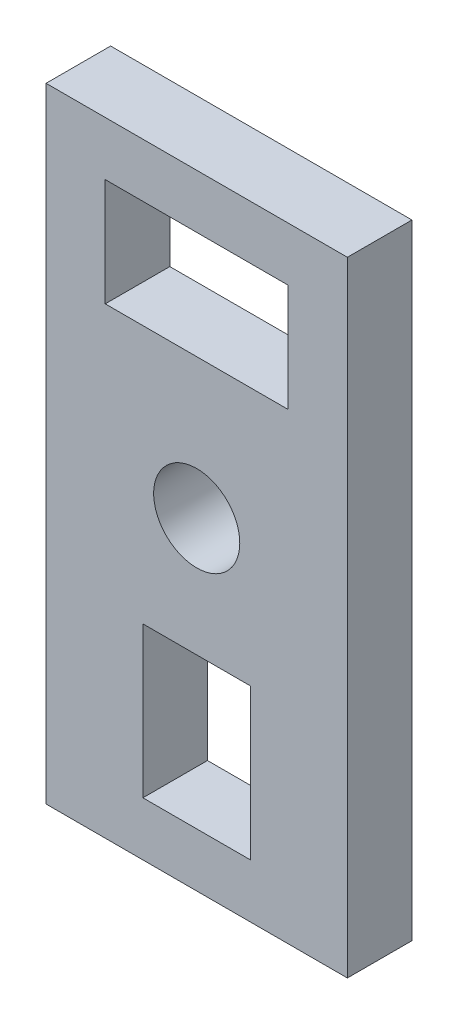
ISO-10303-21;
HEADER;
FILE_DESCRIPTION(('STEP AP214'),'2;1');
FILE_NAME('part.step','',(''),(''),'','','');
FILE_SCHEMA(('AUTOMOTIVE_DESIGN { 1 0 10303 214 1 1 1 1 }'));
ENDSEC;
DATA;
#1=APPLICATION_CONTEXT('core data for automotive mechanical design processes');
#2=APPLICATION_PROTOCOL_DEFINITION('international standard','automotive_design',2000,#1);
#3=PRODUCT_CONTEXT('',#1,'mechanical');
#4=PRODUCT('Part','Part','',(#3));
#5=PRODUCT_RELATED_PRODUCT_CATEGORY('part','',(#4));
#6=PRODUCT_DEFINITION_FORMATION('','',#4);
#7=PRODUCT_DEFINITION_CONTEXT('part definition',#1,'design');
#8=PRODUCT_DEFINITION('design','',#6,#7);
#9=PRODUCT_DEFINITION_SHAPE('','',#8);
#10=(LENGTH_UNIT() NAMED_UNIT(*) SI_UNIT(.MILLI.,.METRE.));
#11=(NAMED_UNIT(*) PLANE_ANGLE_UNIT() SI_UNIT($,.RADIAN.));
#12=(NAMED_UNIT(*) SI_UNIT($,.STERADIAN.) SOLID_ANGLE_UNIT());
#13=UNCERTAINTY_MEASURE_WITH_UNIT(LENGTH_MEASURE(1.E-05),#10,'distance_accuracy_value','');
#14=(GEOMETRIC_REPRESENTATION_CONTEXT(3) GLOBAL_UNCERTAINTY_ASSIGNED_CONTEXT((#13)) GLOBAL_UNIT_ASSIGNED_CONTEXT((#10,
#11,#12)) REPRESENTATION_CONTEXT('',''));
#15=CARTESIAN_POINT('',(0.,0.,0.));
#16=DIRECTION('',(0.,0.,1.));
#17=DIRECTION('',(1.,0.,0.));
#18=AXIS2_PLACEMENT_3D('',#15,#16,#17);
#19=CARTESIAN_POINT('',(0.,0.,3.));
#20=DIRECTION('',(0.,0.,-1.));
#21=DIRECTION('',(-1.,0.,0.));
#22=AXIS2_PLACEMENT_3D('',#19,#20,#21);
#23=PLANE('',#22);
#24=DIRECTION('',(0.,-1.,0.));
#25=VECTOR('',#24,1.);
#26=CARTESIAN_POINT('',(17.,0.,3.));
#27=LINE('',#26,#25);
#28=CARTESIAN_POINT('',(17.,34.,3.));
#29=VERTEX_POINT('',#28);
#30=CARTESIAN_POINT('',(17.,5.,3.));
#31=VERTEX_POINT('',#30);
#32=EDGE_CURVE('E153',#29,#31,#27,.T.);
#33=ORIENTED_EDGE('',*,*,#32,.F.);
#34=DIRECTION('',(1.,0.,0.));
#35=VECTOR('',#34,1.);
#36=CARTESIAN_POINT('',(0.,34.,3.));
#37=LINE('',#36,#35);
#38=CARTESIAN_POINT('',(3.,34.,3.));
#39=VERTEX_POINT('',#38);
#40=EDGE_CURVE('E57',#39,#29,#37,.T.);
#41=ORIENTED_EDGE('',*,*,#40,.F.);
#42=DIRECTION('',(0.,1.,0.));
#43=VECTOR('',#42,1.);
#44=CARTESIAN_POINT('',(3.,0.,3.));
#45=LINE('',#44,#43);
#46=CARTESIAN_POINT('',(3.,5.,3.));
#47=VERTEX_POINT('',#46);
#48=EDGE_CURVE('E144',#47,#39,#45,.T.);
#49=ORIENTED_EDGE('',*,*,#48,.F.);
#50=DIRECTION('',(1.,0.,0.));
#51=VECTOR('',#50,1.);
#52=CARTESIAN_POINT('',(0.,5.,3.));
#53=LINE('',#52,#51);
#54=EDGE_CURVE('E160',#47,#31,#53,.T.);
#55=ORIENTED_EDGE('',*,*,#54,.T.);
#56=EDGE_LOOP('',(#33,#41,#49,#55));
#57=FACE_BOUND('',#56,.T.);
#58=DIRECTION('',(1.,0.,0.));
#59=VECTOR('',#58,1.);
#60=CARTESIAN_POINT('',(5.75,26.5,3.));
#61=LINE('',#60,#59);
#62=CARTESIAN_POINT('',(5.75,26.5,3.));
#63=VERTEX_POINT('',#62);
#64=CARTESIAN_POINT('',(14.25,26.5,3.));
#65=VERTEX_POINT('',#64);
#66=EDGE_CURVE('E191',#63,#65,#61,.T.);
#67=ORIENTED_EDGE('',*,*,#66,.F.);
#68=DIRECTION('',(0.,-1.,0.));
#69=VECTOR('',#68,1.);
#70=CARTESIAN_POINT('',(5.75,31.5,3.));
#71=LINE('',#70,#69);
#72=CARTESIAN_POINT('',(5.75,31.5,3.));
#73=VERTEX_POINT('',#72);
#74=EDGE_CURVE('E188',#73,#63,#71,.T.);
#75=ORIENTED_EDGE('',*,*,#74,.F.);
#76=DIRECTION('',(-1.,0.,0.));
#77=VECTOR('',#76,1.);
#78=CARTESIAN_POINT('',(5.75,31.5,3.));
#79=LINE('',#78,#77);
#80=CARTESIAN_POINT('',(14.25,31.5,3.));
#81=VERTEX_POINT('',#80);
#82=EDGE_CURVE('E199',#81,#73,#79,.T.);
#83=ORIENTED_EDGE('',*,*,#82,.F.);
#84=DIRECTION('',(0.,1.,0.));
#85=VECTOR('',#84,1.);
#86=CARTESIAN_POINT('',(14.25,31.5,3.));
#87=LINE('',#86,#85);
#88=EDGE_CURVE('E195',#65,#81,#87,.T.);
#89=ORIENTED_EDGE('',*,*,#88,.F.);
#90=EDGE_LOOP('',(#67,#75,#83,#89));
#91=FACE_BOUND('',#90,.T.);
#92=DIRECTION('',(1.,0.,0.));
#93=VECTOR('',#92,1.);
#94=CARTESIAN_POINT('',(7.5,7.5,3.));
#95=LINE('',#94,#93);
#96=CARTESIAN_POINT('',(7.5,7.5,3.));
#97=VERTEX_POINT('',#96);
#98=CARTESIAN_POINT('',(12.5,7.5,3.));
#99=VERTEX_POINT('',#98);
#100=EDGE_CURVE('E231',#97,#99,#95,.T.);
#101=ORIENTED_EDGE('',*,*,#100,.F.);
#102=DIRECTION('',(0.,-1.,0.));
#103=VECTOR('',#102,1.);
#104=CARTESIAN_POINT('',(7.5,14.5,3.));
#105=LINE('',#104,#103);
#106=CARTESIAN_POINT('',(7.5,14.5,3.));
#107=VERTEX_POINT('',#106);
#108=EDGE_CURVE('E228',#107,#97,#105,.T.);
#109=ORIENTED_EDGE('',*,*,#108,.F.);
#110=DIRECTION('',(-1.,0.,0.));
#111=VECTOR('',#110,1.);
#112=CARTESIAN_POINT('',(7.5,14.5,3.));
#113=LINE('',#112,#111);
#114=CARTESIAN_POINT('',(12.5,14.5,3.));
#115=VERTEX_POINT('',#114);
#116=EDGE_CURVE('E239',#115,#107,#113,.T.);
#117=ORIENTED_EDGE('',*,*,#116,.F.);
#118=DIRECTION('',(0.,1.,0.));
#119=VECTOR('',#118,1.);
#120=CARTESIAN_POINT('',(12.5,14.5,3.));
#121=LINE('',#120,#119);
#122=EDGE_CURVE('E235',#99,#115,#121,.T.);
#123=ORIENTED_EDGE('',*,*,#122,.F.);
#124=EDGE_LOOP('',(#101,#109,#117,#123));
#125=FACE_BOUND('',#124,.T.);
#126=CARTESIAN_POINT('',(10.,20.,3.));
#127=DIRECTION('',(0.,0.,1.));
#128=DIRECTION('',(1.,0.,0.));
#129=AXIS2_PLACEMENT_3D('',#126,#127,#128);
#130=CIRCLE('',#129,2.);
#131=CARTESIAN_POINT('',(12.,20.,3.));
#132=VERTEX_POINT('',#131);
#133=EDGE_CURVE('E220',#132,#132,#130,.T.);
#134=ORIENTED_EDGE('',*,*,#133,.F.);
#135=EDGE_LOOP('',(#134));
#136=FACE_BOUND('',#135,.T.);
#137=ADVANCED_FACE('F39',(#57,#91,#125,#136),#23,.F.);
#138=CARTESIAN_POINT('',(0.,0.,0.));
#139=DIRECTION('',(0.,0.,-1.));
#140=DIRECTION('',(-1.,0.,0.));
#141=AXIS2_PLACEMENT_3D('',#138,#139,#140);
#142=PLANE('',#141);
#143=DIRECTION('',(1.,0.,0.));
#144=VECTOR('',#143,1.);
#145=CARTESIAN_POINT('',(0.,34.,0.));
#146=LINE('',#145,#144);
#147=CARTESIAN_POINT('',(3.,34.,0.));
#148=VERTEX_POINT('',#147);
#149=CARTESIAN_POINT('',(17.,34.,0.));
#150=VERTEX_POINT('',#149);
#151=EDGE_CURVE('E141',#148,#150,#146,.T.);
#152=ORIENTED_EDGE('',*,*,#151,.T.);
#153=DIRECTION('',(0.,-1.,0.));
#154=VECTOR('',#153,1.);
#155=CARTESIAN_POINT('',(17.,0.,0.));
#156=LINE('',#155,#154);
#157=CARTESIAN_POINT('',(17.,5.,0.));
#158=VERTEX_POINT('',#157);
#159=EDGE_CURVE('E130',#150,#158,#156,.T.);
#160=ORIENTED_EDGE('',*,*,#159,.T.);
#161=DIRECTION('',(1.,0.,0.));
#162=VECTOR('',#161,1.);
#163=CARTESIAN_POINT('',(0.,5.,0.));
#164=LINE('',#163,#162);
#165=CARTESIAN_POINT('',(3.,5.,0.));
#166=VERTEX_POINT('',#165);
#167=EDGE_CURVE('E138',#166,#158,#164,.T.);
#168=ORIENTED_EDGE('',*,*,#167,.F.);
#169=DIRECTION('',(0.,1.,0.));
#170=VECTOR('',#169,1.);
#171=CARTESIAN_POINT('',(3.,0.,0.));
#172=LINE('',#171,#170);
#173=EDGE_CURVE('E148',#166,#148,#172,.T.);
#174=ORIENTED_EDGE('',*,*,#173,.T.);
#175=EDGE_LOOP('',(#152,#160,#168,#174));
#176=FACE_BOUND('',#175,.T.);
#177=DIRECTION('',(0.,-1.,0.));
#178=VECTOR('',#177,1.);
#179=CARTESIAN_POINT('',(5.75,31.5,0.));
#180=LINE('',#179,#178);
#181=CARTESIAN_POINT('',(5.75,31.5,0.));
#182=VERTEX_POINT('',#181);
#183=CARTESIAN_POINT('',(5.75,26.5,0.));
#184=VERTEX_POINT('',#183);
#185=EDGE_CURVE('E184',#182,#184,#180,.T.);
#186=ORIENTED_EDGE('',*,*,#185,.T.);
#187=DIRECTION('',(1.,0.,0.));
#188=VECTOR('',#187,1.);
#189=CARTESIAN_POINT('',(5.75,26.5,0.));
#190=LINE('',#189,#188);
#191=CARTESIAN_POINT('',(14.25,26.5,0.));
#192=VERTEX_POINT('',#191);
#193=EDGE_CURVE('E11',#184,#192,#190,.T.);
#194=ORIENTED_EDGE('',*,*,#193,.T.);
#195=DIRECTION('',(0.,1.,0.));
#196=VECTOR('',#195,1.);
#197=CARTESIAN_POINT('',(14.25,31.5,0.));
#198=LINE('',#197,#196);
#199=CARTESIAN_POINT('',(14.25,31.5,0.));
#200=VERTEX_POINT('',#199);
#201=EDGE_CURVE('E175',#192,#200,#198,.T.);
#202=ORIENTED_EDGE('',*,*,#201,.T.);
#203=DIRECTION('',(-1.,0.,0.));
#204=VECTOR('',#203,1.);
#205=CARTESIAN_POINT('',(5.75,31.5,0.));
#206=LINE('',#205,#204);
#207=EDGE_CURVE('E179',#200,#182,#206,.T.);
#208=ORIENTED_EDGE('',*,*,#207,.T.);
#209=EDGE_LOOP('',(#186,#194,#202,#208));
#210=FACE_BOUND('',#209,.T.);
#211=DIRECTION('',(0.,-1.,0.));
#212=VECTOR('',#211,1.);
#213=CARTESIAN_POINT('',(7.5,14.5,0.));
#214=LINE('',#213,#212);
#215=CARTESIAN_POINT('',(7.5,14.5,0.));
#216=VERTEX_POINT('',#215);
#217=CARTESIAN_POINT('',(7.5,7.5,0.));
#218=VERTEX_POINT('',#217);
#219=EDGE_CURVE('E224',#216,#218,#214,.T.);
#220=ORIENTED_EDGE('',*,*,#219,.T.);
#221=DIRECTION('',(1.,0.,0.));
#222=VECTOR('',#221,1.);
#223=CARTESIAN_POINT('',(7.5,7.5,0.));
#224=LINE('',#223,#222);
#225=CARTESIAN_POINT('',(12.5,7.5,0.));
#226=VERTEX_POINT('',#225);
#227=EDGE_CURVE('E180',#218,#226,#224,.T.);
#228=ORIENTED_EDGE('',*,*,#227,.T.);
#229=DIRECTION('',(0.,1.,0.));
#230=VECTOR('',#229,1.);
#231=CARTESIAN_POINT('',(12.5,14.5,0.));
#232=LINE('',#231,#230);
#233=CARTESIAN_POINT('',(12.5,14.5,0.));
#234=VERTEX_POINT('',#233);
#235=EDGE_CURVE('E215',#226,#234,#232,.T.);
#236=ORIENTED_EDGE('',*,*,#235,.T.);
#237=DIRECTION('',(-1.,0.,0.));
#238=VECTOR('',#237,1.);
#239=CARTESIAN_POINT('',(7.5,14.5,0.));
#240=LINE('',#239,#238);
#241=EDGE_CURVE('E219',#234,#216,#240,.T.);
#242=ORIENTED_EDGE('',*,*,#241,.T.);
#243=EDGE_LOOP('',(#220,#228,#236,#242));
#244=FACE_BOUND('',#243,.T.);
#245=CARTESIAN_POINT('',(10.,20.,0.));
#246=DIRECTION('',(0.,0.,-1.));
#247=DIRECTION('',(-1.,0.,0.));
#248=AXIS2_PLACEMENT_3D('',#245,#246,#247);
#249=CIRCLE('',#248,2.);
#250=CARTESIAN_POINT('',(8.,20.,0.));
#251=VERTEX_POINT('',#250);
#252=EDGE_CURVE('E43',#251,#251,#249,.F.);
#253=ORIENTED_EDGE('',*,*,#252,.T.);
#254=EDGE_LOOP('',(#253));
#255=FACE_BOUND('',#254,.T.);
#256=ADVANCED_FACE('F41',(#176,#210,#244,#255),#142,.T.);
#257=CARTESIAN_POINT('',(10.,20.,-0.00100000000000013));
#258=DIRECTION('',(0.,0.,1.));
#259=DIRECTION('',(1.,0.,0.));
#260=AXIS2_PLACEMENT_3D('',#257,#258,#259);
#261=CYLINDRICAL_SURFACE('',#260,2.);
#262=ORIENTED_EDGE('',*,*,#252,.F.);
#263=EDGE_LOOP('',(#262));
#264=FACE_BOUND('',#263,.T.);
#265=ORIENTED_EDGE('',*,*,#133,.T.);
#266=EDGE_LOOP('',(#265));
#267=FACE_BOUND('',#266,.T.);
#268=ADVANCED_FACE('F267',(#264,#267),#261,.F.);
#269=CARTESIAN_POINT('',(7.5,14.5,-0.00100000000000013));
#270=DIRECTION('',(-1.,0.,0.));
#271=DIRECTION('',(0.,-1.,0.));
#272=AXIS2_PLACEMENT_3D('',#269,#270,#271);
#273=PLANE('',#272);
#274=DIRECTION('',(0.,0.,1.));
#275=VECTOR('',#274,1.);
#276=CARTESIAN_POINT('',(7.5,14.5,-0.00100000000000013));
#277=LINE('',#276,#275);
#278=EDGE_CURVE('E244',#216,#107,#277,.T.);
#279=ORIENTED_EDGE('',*,*,#278,.T.);
#280=ORIENTED_EDGE('',*,*,#108,.T.);
#281=DIRECTION('',(0.,0.,1.));
#282=VECTOR('',#281,1.);
#283=CARTESIAN_POINT('',(7.5,7.5,-0.00100000000000013));
#284=LINE('',#283,#282);
#285=EDGE_CURVE('E243',#218,#97,#284,.T.);
#286=ORIENTED_EDGE('',*,*,#285,.F.);
#287=ORIENTED_EDGE('',*,*,#219,.F.);
#288=EDGE_LOOP('',(#279,#280,#286,#287));
#289=FACE_BOUND('',#288,.T.);
#290=ADVANCED_FACE('F269',(#289),#273,.F.);
#291=CARTESIAN_POINT('',(7.5,14.5,-0.00100000000000013));
#292=DIRECTION('',(0.,1.,0.));
#293=DIRECTION('',(0.,0.,1.));
#294=AXIS2_PLACEMENT_3D('',#291,#292,#293);
#295=PLANE('',#294);
#296=DIRECTION('',(0.,0.,1.));
#297=VECTOR('',#296,1.);
#298=CARTESIAN_POINT('',(12.5,14.5,-0.00100000000000013));
#299=LINE('',#298,#297);
#300=EDGE_CURVE('E247',#234,#115,#299,.T.);
#301=ORIENTED_EDGE('',*,*,#300,.T.);
#302=ORIENTED_EDGE('',*,*,#116,.T.);
#303=ORIENTED_EDGE('',*,*,#278,.F.);
#304=ORIENTED_EDGE('',*,*,#241,.F.);
#305=EDGE_LOOP('',(#301,#302,#303,#304));
#306=FACE_BOUND('',#305,.T.);
#307=ADVANCED_FACE('F275',(#306),#295,.F.);
#308=CARTESIAN_POINT('',(12.5,14.5,-0.00100000000000013));
#309=DIRECTION('',(1.,0.,0.));
#310=DIRECTION('',(0.,0.,-1.));
#311=AXIS2_PLACEMENT_3D('',#308,#309,#310);
#312=PLANE('',#311);
#313=DIRECTION('',(0.,0.,1.));
#314=VECTOR('',#313,1.);
#315=CARTESIAN_POINT('',(12.5,7.5,-0.00100000000000013));
#316=LINE('',#315,#314);
#317=EDGE_CURVE('E250',#226,#99,#316,.T.);
#318=ORIENTED_EDGE('',*,*,#317,.T.);
#319=ORIENTED_EDGE('',*,*,#122,.T.);
#320=ORIENTED_EDGE('',*,*,#300,.F.);
#321=ORIENTED_EDGE('',*,*,#235,.F.);
#322=EDGE_LOOP('',(#318,#319,#320,#321));
#323=FACE_BOUND('',#322,.T.);
#324=ADVANCED_FACE('F301',(#323),#312,.F.);
#325=CARTESIAN_POINT('',(7.5,7.5,-0.00100000000000013));
#326=DIRECTION('',(0.,-1.,0.));
#327=DIRECTION('',(0.,0.,-1.));
#328=AXIS2_PLACEMENT_3D('',#325,#326,#327);
#329=PLANE('',#328);
#330=ORIENTED_EDGE('',*,*,#285,.T.);
#331=ORIENTED_EDGE('',*,*,#100,.T.);
#332=ORIENTED_EDGE('',*,*,#317,.F.);
#333=ORIENTED_EDGE('',*,*,#227,.F.);
#334=EDGE_LOOP('',(#330,#331,#332,#333));
#335=FACE_BOUND('',#334,.T.);
#336=ADVANCED_FACE('F293',(#335),#329,.F.);
#337=CARTESIAN_POINT('',(5.75,31.5,-0.00100000000000013));
#338=DIRECTION('',(-1.,0.,0.));
#339=DIRECTION('',(0.,-1.,0.));
#340=AXIS2_PLACEMENT_3D('',#337,#338,#339);
#341=PLANE('',#340);
#342=DIRECTION('',(0.,0.,1.));
#343=VECTOR('',#342,1.);
#344=CARTESIAN_POINT('',(5.75,31.5,-0.00100000000000013));
#345=LINE('',#344,#343);
#346=EDGE_CURVE('E49',#182,#73,#345,.T.);
#347=ORIENTED_EDGE('',*,*,#346,.T.);
#348=ORIENTED_EDGE('',*,*,#74,.T.);
#349=DIRECTION('',(0.,0.,1.));
#350=VECTOR('',#349,1.);
#351=CARTESIAN_POINT('',(5.75,26.5,-0.00100000000000013));
#352=LINE('',#351,#350);
#353=EDGE_CURVE('E203',#184,#63,#352,.T.);
#354=ORIENTED_EDGE('',*,*,#353,.F.);
#355=ORIENTED_EDGE('',*,*,#185,.F.);
#356=EDGE_LOOP('',(#347,#348,#354,#355));
#357=FACE_BOUND('',#356,.T.);
#358=ADVANCED_FACE('F308',(#357),#341,.F.);
#359=CARTESIAN_POINT('',(5.75,31.5,-0.00100000000000013));
#360=DIRECTION('',(0.,1.,0.));
#361=DIRECTION('',(0.,0.,1.));
#362=AXIS2_PLACEMENT_3D('',#359,#360,#361);
#363=PLANE('',#362);
#364=DIRECTION('',(0.,0.,1.));
#365=VECTOR('',#364,1.);
#366=CARTESIAN_POINT('',(14.25,31.5,-0.00100000000000013));
#367=LINE('',#366,#365);
#368=EDGE_CURVE('E206',#200,#81,#367,.T.);
#369=ORIENTED_EDGE('',*,*,#368,.T.);
#370=ORIENTED_EDGE('',*,*,#82,.T.);
#371=ORIENTED_EDGE('',*,*,#346,.F.);
#372=ORIENTED_EDGE('',*,*,#207,.F.);
#373=EDGE_LOOP('',(#369,#370,#371,#372));
#374=FACE_BOUND('',#373,.T.);
#375=ADVANCED_FACE('F314',(#374),#363,.F.);
#376=CARTESIAN_POINT('',(14.25,31.5,-0.00100000000000013));
#377=DIRECTION('',(1.,0.,0.));
#378=DIRECTION('',(0.,1.,0.));
#379=AXIS2_PLACEMENT_3D('',#376,#377,#378);
#380=PLANE('',#379);
#381=DIRECTION('',(0.,0.,1.));
#382=VECTOR('',#381,1.);
#383=CARTESIAN_POINT('',(14.25,26.5,-0.00100000000000013));
#384=LINE('',#383,#382);
#385=EDGE_CURVE('E209',#192,#65,#384,.T.);
#386=ORIENTED_EDGE('',*,*,#385,.T.);
#387=ORIENTED_EDGE('',*,*,#88,.T.);
#388=ORIENTED_EDGE('',*,*,#368,.F.);
#389=ORIENTED_EDGE('',*,*,#201,.F.);
#390=EDGE_LOOP('',(#386,#387,#388,#389));
#391=FACE_BOUND('',#390,.T.);
#392=ADVANCED_FACE('F319',(#391),#380,.F.);
#393=CARTESIAN_POINT('',(5.75,26.5,-0.00100000000000013));
#394=DIRECTION('',(0.,-1.,0.));
#395=DIRECTION('',(0.,0.,-1.));
#396=AXIS2_PLACEMENT_3D('',#393,#394,#395);
#397=PLANE('',#396);
#398=ORIENTED_EDGE('',*,*,#353,.T.);
#399=ORIENTED_EDGE('',*,*,#66,.T.);
#400=ORIENTED_EDGE('',*,*,#385,.F.);
#401=ORIENTED_EDGE('',*,*,#193,.F.);
#402=EDGE_LOOP('',(#398,#399,#400,#401));
#403=FACE_BOUND('',#402,.T.);
#404=ADVANCED_FACE('F316',(#403),#397,.F.);
#405=CARTESIAN_POINT('',(0.,34.,-0.00100000000000013));
#406=DIRECTION('',(0.,-1.,0.));
#407=DIRECTION('',(0.,0.,-1.));
#408=AXIS2_PLACEMENT_3D('',#405,#406,#407);
#409=PLANE('',#408);
#410=DIRECTION('',(0.,0.,1.));
#411=VECTOR('',#410,1.);
#412=CARTESIAN_POINT('',(3.,34.,-0.00100000000000013));
#413=LINE('',#412,#411);
#414=EDGE_CURVE('E167',#148,#39,#413,.T.);
#415=ORIENTED_EDGE('',*,*,#414,.T.);
#416=ORIENTED_EDGE('',*,*,#40,.T.);
#417=DIRECTION('',(0.,0.,1.));
#418=VECTOR('',#417,1.);
#419=CARTESIAN_POINT('',(17.,34.,-0.00100000000000013));
#420=LINE('',#419,#418);
#421=EDGE_CURVE('E132',#150,#29,#420,.T.);
#422=ORIENTED_EDGE('',*,*,#421,.F.);
#423=ORIENTED_EDGE('',*,*,#151,.F.);
#424=EDGE_LOOP('',(#415,#416,#422,#423));
#425=FACE_BOUND('',#424,.T.);
#426=ADVANCED_FACE('F140',(#425),#409,.F.);
#427=CARTESIAN_POINT('',(3.,0.,-0.00100000000000013));
#428=DIRECTION('',(1.,0.,0.));
#429=DIRECTION('',(0.,0.,-1.));
#430=AXIS2_PLACEMENT_3D('',#427,#428,#429);
#431=PLANE('',#430);
#432=DIRECTION('',(0.,0.,1.));
#433=VECTOR('',#432,1.);
#434=CARTESIAN_POINT('',(3.,5.,-0.00100000000000013));
#435=LINE('',#434,#433);
#436=EDGE_CURVE('E170',#166,#47,#435,.T.);
#437=ORIENTED_EDGE('',*,*,#436,.T.);
#438=ORIENTED_EDGE('',*,*,#48,.T.);
#439=ORIENTED_EDGE('',*,*,#414,.F.);
#440=ORIENTED_EDGE('',*,*,#173,.F.);
#441=EDGE_LOOP('',(#437,#438,#439,#440));
#442=FACE_BOUND('',#441,.T.);
#443=ADVANCED_FACE('F329',(#442),#431,.F.);
#444=CARTESIAN_POINT('',(0.,5.,-0.00100000000000013));
#445=DIRECTION('',(0.,-1.,0.));
#446=DIRECTION('',(0.,0.,-1.));
#447=AXIS2_PLACEMENT_3D('',#444,#445,#446);
#448=PLANE('',#447);
#449=ORIENTED_EDGE('',*,*,#167,.T.);
#450=DIRECTION('',(0.,0.,1.));
#451=VECTOR('',#450,1.);
#452=CARTESIAN_POINT('',(17.,5.,-0.00100000000000013));
#453=LINE('',#452,#451);
#454=EDGE_CURVE('E65',#158,#31,#453,.T.);
#455=ORIENTED_EDGE('',*,*,#454,.T.);
#456=ORIENTED_EDGE('',*,*,#54,.F.);
#457=ORIENTED_EDGE('',*,*,#436,.F.);
#458=EDGE_LOOP('',(#449,#455,#456,#457));
#459=FACE_BOUND('',#458,.T.);
#460=ADVANCED_FACE('F332',(#459),#448,.T.);
#461=CARTESIAN_POINT('',(17.,0.,-0.00100000000000013));
#462=DIRECTION('',(-1.,0.,0.));
#463=DIRECTION('',(0.,-1.,0.));
#464=AXIS2_PLACEMENT_3D('',#461,#462,#463);
#465=PLANE('',#464);
#466=ORIENTED_EDGE('',*,*,#421,.T.);
#467=ORIENTED_EDGE('',*,*,#32,.T.);
#468=ORIENTED_EDGE('',*,*,#454,.F.);
#469=ORIENTED_EDGE('',*,*,#159,.F.);
#470=EDGE_LOOP('',(#466,#467,#468,#469));
#471=FACE_BOUND('',#470,.T.);
#472=ADVANCED_FACE('F131',(#471),#465,.F.);
#473=CLOSED_SHELL('',(#137,#256,#268,#290,#307,#324,#336,#358,#375,#392,#404,#426,#443,#460,#472));
#474=MANIFOLD_SOLID_BREP('B2',#473);
#475=ADVANCED_BREP_SHAPE_REPRESENTATION('',(#18,#474),#14);
#476=SHAPE_DEFINITION_REPRESENTATION(#9,#475);
ENDSEC;
END-ISO-10303-21;
